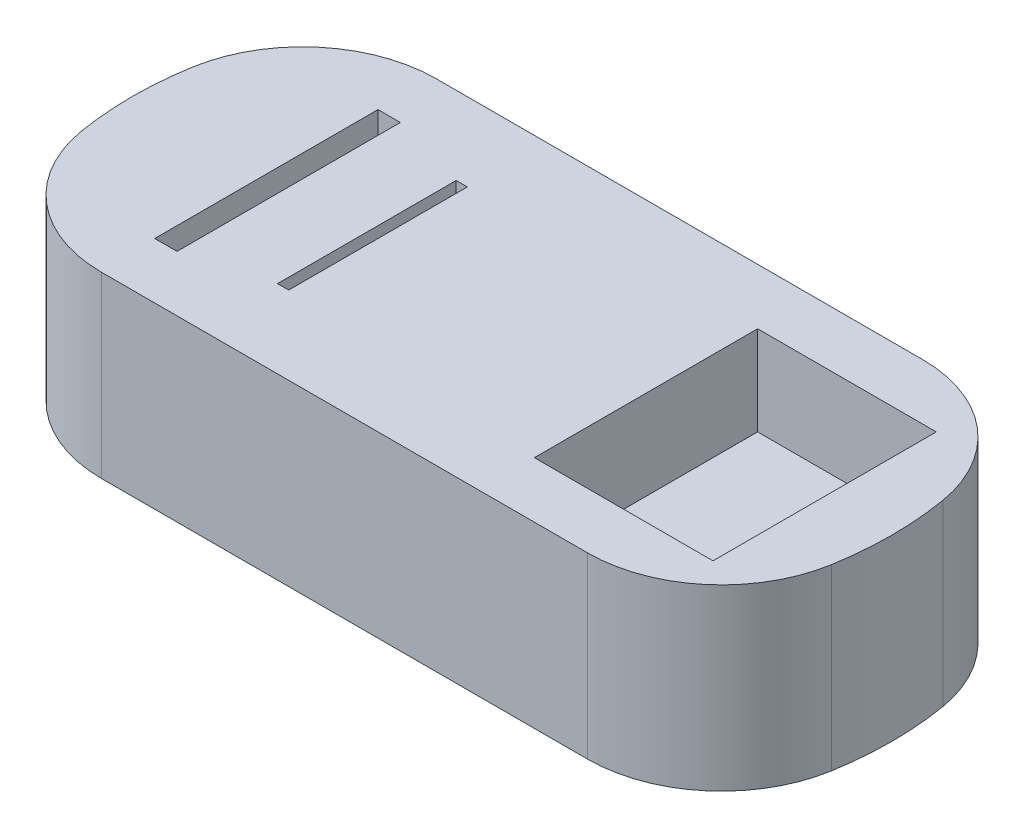
ISO-10303-21;
HEADER;
FILE_DESCRIPTION(('STEP AP214'),'2;1');
FILE_NAME('part.step','',(''),(''),'','','');
FILE_SCHEMA(('AUTOMOTIVE_DESIGN { 1 0 10303 214 1 1 1 1 }'));
ENDSEC;
DATA;
#1=APPLICATION_CONTEXT('core data for automotive mechanical design processes');
#2=APPLICATION_PROTOCOL_DEFINITION('international standard','automotive_design',2000,#1);
#3=PRODUCT_CONTEXT('',#1,'mechanical');
#4=PRODUCT('Part','Part','',(#3));
#5=PRODUCT_RELATED_PRODUCT_CATEGORY('part','',(#4));
#6=PRODUCT_DEFINITION_FORMATION('','',#4);
#7=PRODUCT_DEFINITION_CONTEXT('part definition',#1,'design');
#8=PRODUCT_DEFINITION('design','',#6,#7);
#9=PRODUCT_DEFINITION_SHAPE('','',#8);
#10=(LENGTH_UNIT() NAMED_UNIT(*) SI_UNIT(.MILLI.,.METRE.));
#11=(NAMED_UNIT(*) PLANE_ANGLE_UNIT() SI_UNIT($,.RADIAN.));
#12=(NAMED_UNIT(*) SI_UNIT($,.STERADIAN.) SOLID_ANGLE_UNIT());
#13=UNCERTAINTY_MEASURE_WITH_UNIT(LENGTH_MEASURE(1.E-05),#10,'distance_accuracy_value','');
#14=(GEOMETRIC_REPRESENTATION_CONTEXT(3) GLOBAL_UNCERTAINTY_ASSIGNED_CONTEXT((#13)) GLOBAL_UNIT_ASSIGNED_CONTEXT((#10,
#11,#12)) REPRESENTATION_CONTEXT('',''));
#15=CARTESIAN_POINT('',(0.,0.,0.));
#16=DIRECTION('',(0.,0.,1.));
#17=DIRECTION('',(1.,0.,0.));
#18=AXIS2_PLACEMENT_3D('',#15,#16,#17);
#19=CARTESIAN_POINT('',(20.0961894323342,80.,0.));
#20=DIRECTION('',(0.,-1.,0.));
#21=DIRECTION('',(0.,0.,-1.));
#22=AXIS2_PLACEMENT_3D('',#19,#20,#21);
#23=CYLINDRICAL_SURFACE('',#22,150.);
#24=CARTESIAN_POINT('',(20.0961894323342,0.,0.));
#25=DIRECTION('',(0.,1.,0.));
#26=DIRECTION('',(0.,0.,-1.));
#27=AXIS2_PLACEMENT_3D('',#24,#25,#26);
#28=CIRCLE('',#27,150.);
#29=CARTESIAN_POINT('',(167.998184009825,0.,25.));
#30=VERTEX_POINT('',#29);
#31=CARTESIAN_POINT('',(167.998184009825,0.,-25.));
#32=VERTEX_POINT('',#31);
#33=EDGE_CURVE('E266',#30,#32,#28,.T.);
#34=ORIENTED_EDGE('',*,*,#33,.T.);
#35=DIRECTION('',(0.,-1.,0.));
#36=VECTOR('',#35,1.);
#37=CARTESIAN_POINT('',(167.998184009825,80.,-25.));
#38=LINE('',#37,#36);
#39=CARTESIAN_POINT('',(167.998184009825,80.,-25.));
#40=VERTEX_POINT('',#39);
#41=EDGE_CURVE('E325',#32,#40,#38,.F.);
#42=ORIENTED_EDGE('',*,*,#41,.T.);
#43=CARTESIAN_POINT('',(20.0961894323342,80.,0.));
#44=DIRECTION('',(0.,1.,0.));
#45=DIRECTION('',(0.,0.,-1.));
#46=AXIS2_PLACEMENT_3D('',#43,#44,#45);
#47=CIRCLE('',#46,150.);
#48=CARTESIAN_POINT('',(167.998184009825,80.,25.));
#49=VERTEX_POINT('',#48);
#50=EDGE_CURVE('E273',#49,#40,#47,.T.);
#51=ORIENTED_EDGE('',*,*,#50,.F.);
#52=DIRECTION('',(0.,-1.,0.));
#53=VECTOR('',#52,1.);
#54=CARTESIAN_POINT('',(167.998184009825,80.,25.));
#55=LINE('',#54,#53);
#56=EDGE_CURVE('E322',#49,#30,#55,.T.);
#57=ORIENTED_EDGE('',*,*,#56,.T.);
#58=EDGE_LOOP('',(#34,#42,#51,#57));
#59=FACE_BOUND('',#58,.T.);
#60=ADVANCED_FACE('F38',(#59),#23,.T.);
#61=CARTESIAN_POINT('',(-150.,80.,-75.));
#62=DIRECTION('',(0.,0.,1.));
#63=DIRECTION('',(1.,0.,0.));
#64=AXIS2_PLACEMENT_3D('',#61,#62,#63);
#65=PLANE('',#64);
#66=DIRECTION('',(-1.,0.,0.));
#67=VECTOR('',#66,1.);
#68=CARTESIAN_POINT('',(-150.,0.,-75.));
#69=LINE('',#68,#67);
#70=CARTESIAN_POINT('',(108.837386178828,0.,-75.));
#71=VERTEX_POINT('',#70);
#72=CARTESIAN_POINT('',(-108.837386178828,0.,-75.));
#73=VERTEX_POINT('',#72);
#74=EDGE_CURVE('E289',#71,#73,#69,.T.);
#75=ORIENTED_EDGE('',*,*,#74,.T.);
#76=DIRECTION('',(0.,-1.,0.));
#77=VECTOR('',#76,1.);
#78=CARTESIAN_POINT('',(-108.837386178828,80.,-75.));
#79=LINE('',#78,#77);
#80=CARTESIAN_POINT('',(-108.837386178828,80.,-75.));
#81=VERTEX_POINT('',#80);
#82=EDGE_CURVE('E312',#73,#81,#79,.F.);
#83=ORIENTED_EDGE('',*,*,#82,.T.);
#84=DIRECTION('',(-1.,0.,0.));
#85=VECTOR('',#84,1.);
#86=CARTESIAN_POINT('',(-150.,80.,-75.));
#87=LINE('',#86,#85);
#88=CARTESIAN_POINT('',(108.837386178828,80.,-75.));
#89=VERTEX_POINT('',#88);
#90=EDGE_CURVE('E276',#89,#81,#87,.T.);
#91=ORIENTED_EDGE('',*,*,#90,.F.);
#92=DIRECTION('',(0.,-1.,0.));
#93=VECTOR('',#92,1.);
#94=CARTESIAN_POINT('',(108.837386178828,80.,-75.));
#95=LINE('',#94,#93);
#96=EDGE_CURVE('E309',#89,#71,#95,.T.);
#97=ORIENTED_EDGE('',*,*,#96,.T.);
#98=EDGE_LOOP('',(#75,#83,#91,#97));
#99=FACE_BOUND('',#98,.T.);
#100=ADVANCED_FACE('F355',(#99),#65,.F.);
#101=CARTESIAN_POINT('',(-20.0961894323342,80.,0.));
#102=DIRECTION('',(0.,-1.,0.));
#103=DIRECTION('',(0.,0.,-1.));
#104=AXIS2_PLACEMENT_3D('',#101,#102,#103);
#105=CYLINDRICAL_SURFACE('',#104,150.);
#106=CARTESIAN_POINT('',(-20.0961894323342,80.,0.));
#107=DIRECTION('',(0.,1.,0.));
#108=DIRECTION('',(0.,0.,1.));
#109=AXIS2_PLACEMENT_3D('',#106,#107,#108);
#110=CIRCLE('',#109,150.);
#111=CARTESIAN_POINT('',(-167.998184009825,80.,-25.));
#112=VERTEX_POINT('',#111);
#113=CARTESIAN_POINT('',(-167.998184009825,80.,25.));
#114=VERTEX_POINT('',#113);
#115=EDGE_CURVE('E280',#112,#114,#110,.T.);
#116=ORIENTED_EDGE('',*,*,#115,.F.);
#117=DIRECTION('',(0.,-1.,0.));
#118=VECTOR('',#117,1.);
#119=CARTESIAN_POINT('',(-167.998184009825,80.,-25.));
#120=LINE('',#119,#118);
#121=CARTESIAN_POINT('',(-167.998184009825,0.,-25.));
#122=VERTEX_POINT('',#121);
#123=EDGE_CURVE('E298',#112,#122,#120,.T.);
#124=ORIENTED_EDGE('',*,*,#123,.T.);
#125=CARTESIAN_POINT('',(-20.0961894323342,0.,0.));
#126=DIRECTION('',(0.,1.,0.));
#127=DIRECTION('',(0.,0.,1.));
#128=AXIS2_PLACEMENT_3D('',#125,#126,#127);
#129=CIRCLE('',#128,150.);
#130=CARTESIAN_POINT('',(-167.998184009825,0.,25.));
#131=VERTEX_POINT('',#130);
#132=EDGE_CURVE('E292',#122,#131,#129,.T.);
#133=ORIENTED_EDGE('',*,*,#132,.T.);
#134=DIRECTION('',(0.,-1.,0.));
#135=VECTOR('',#134,1.);
#136=CARTESIAN_POINT('',(-167.998184009825,80.,25.));
#137=LINE('',#136,#135);
#138=EDGE_CURVE('E286',#131,#114,#137,.F.);
#139=ORIENTED_EDGE('',*,*,#138,.T.);
#140=EDGE_LOOP('',(#116,#124,#133,#139));
#141=FACE_BOUND('',#140,.T.);
#142=ADVANCED_FACE('F363',(#141),#105,.T.);
#143=CARTESIAN_POINT('',(-150.,80.,75.));
#144=DIRECTION('',(0.,0.,-1.));
#145=DIRECTION('',(-1.,0.,0.));
#146=AXIS2_PLACEMENT_3D('',#143,#144,#145);
#147=PLANE('',#146);
#148=DIRECTION('',(1.,0.,0.));
#149=VECTOR('',#148,1.);
#150=CARTESIAN_POINT('',(-150.,0.,75.));
#151=LINE('',#150,#149);
#152=CARTESIAN_POINT('',(-108.837386178828,0.,75.));
#153=VERTEX_POINT('',#152);
#154=CARTESIAN_POINT('',(108.837386178828,0.,75.));
#155=VERTEX_POINT('',#154);
#156=EDGE_CURVE('E277',#153,#155,#151,.T.);
#157=ORIENTED_EDGE('',*,*,#156,.T.);
#158=DIRECTION('',(0.,-1.,0.));
#159=VECTOR('',#158,1.);
#160=CARTESIAN_POINT('',(108.837386178828,80.,75.));
#161=LINE('',#160,#159);
#162=CARTESIAN_POINT('',(108.837386178828,80.,75.));
#163=VERTEX_POINT('',#162);
#164=EDGE_CURVE('E11',#155,#163,#161,.F.);
#165=ORIENTED_EDGE('',*,*,#164,.T.);
#166=DIRECTION('',(1.,0.,0.));
#167=VECTOR('',#166,1.);
#168=CARTESIAN_POINT('',(-150.,80.,75.));
#169=LINE('',#168,#167);
#170=CARTESIAN_POINT('',(-108.837386178828,80.,75.));
#171=VERTEX_POINT('',#170);
#172=EDGE_CURVE('E283',#171,#163,#169,.T.);
#173=ORIENTED_EDGE('',*,*,#172,.F.);
#174=DIRECTION('',(0.,-1.,0.));
#175=VECTOR('',#174,1.);
#176=CARTESIAN_POINT('',(-108.837386178828,80.,75.));
#177=LINE('',#176,#175);
#178=EDGE_CURVE('E46',#171,#153,#177,.T.);
#179=ORIENTED_EDGE('',*,*,#178,.T.);
#180=EDGE_LOOP('',(#157,#165,#173,#179));
#181=FACE_BOUND('',#180,.T.);
#182=ADVANCED_FACE('F331',(#181),#147,.F.);
#183=CARTESIAN_POINT('',(20.0961894323342,80.,0.));
#184=DIRECTION('',(0.,-1.,0.));
#185=DIRECTION('',(0.,0.,-1.));
#186=AXIS2_PLACEMENT_3D('',#183,#184,#185);
#187=PLANE('',#186);
#188=DIRECTION('',(0.,0.,1.));
#189=VECTOR('',#188,1.);
#190=CARTESIAN_POINT('',(140.,80.,-50.));
#191=LINE('',#190,#189);
#192=CARTESIAN_POINT('',(140.,80.,-50.));
#193=VERTEX_POINT('',#192);
#194=CARTESIAN_POINT('',(140.,80.,50.));
#195=VERTEX_POINT('',#194);
#196=EDGE_CURVE('E203',#193,#195,#191,.T.);
#197=ORIENTED_EDGE('',*,*,#196,.T.);
#198=DIRECTION('',(1.,0.,0.));
#199=VECTOR('',#198,1.);
#200=CARTESIAN_POINT('',(60.,80.,50.));
#201=LINE('',#200,#199);
#202=CARTESIAN_POINT('',(60.,80.,50.));
#203=VERTEX_POINT('',#202);
#204=EDGE_CURVE('E53',#203,#195,#201,.T.);
#205=ORIENTED_EDGE('',*,*,#204,.F.);
#206=DIRECTION('',(0.,0.,1.));
#207=VECTOR('',#206,1.);
#208=CARTESIAN_POINT('',(60.,80.,-50.));
#209=LINE('',#208,#207);
#210=CARTESIAN_POINT('',(60.,80.,-50.));
#211=VERTEX_POINT('',#210);
#212=EDGE_CURVE('E194',#211,#203,#209,.T.);
#213=ORIENTED_EDGE('',*,*,#212,.F.);
#214=DIRECTION('',(1.,0.,0.));
#215=VECTOR('',#214,1.);
#216=CARTESIAN_POINT('',(60.,80.,-50.));
#217=LINE('',#216,#215);
#218=EDGE_CURVE('E197',#211,#193,#217,.T.);
#219=ORIENTED_EDGE('',*,*,#218,.T.);
#220=EDGE_LOOP('',(#197,#205,#213,#219));
#221=FACE_BOUND('',#220,.T.);
#222=DIRECTION('',(1.,0.,0.));
#223=VECTOR('',#222,1.);
#224=CARTESIAN_POINT('',(-65.,80.,40.));
#225=LINE('',#224,#223);
#226=CARTESIAN_POINT('',(-65.,80.,40.));
#227=VERTEX_POINT('',#226);
#228=CARTESIAN_POINT('',(-60.,80.,40.));
#229=VERTEX_POINT('',#228);
#230=EDGE_CURVE('E227',#227,#229,#225,.T.);
#231=ORIENTED_EDGE('',*,*,#230,.F.);
#232=DIRECTION('',(0.,0.,1.));
#233=VECTOR('',#232,1.);
#234=CARTESIAN_POINT('',(-65.0000000000001,80.,-40.));
#235=LINE('',#234,#233);
#236=CARTESIAN_POINT('',(-65.0000000000001,80.,-40.));
#237=VERTEX_POINT('',#236);
#238=EDGE_CURVE('E61',#237,#227,#235,.T.);
#239=ORIENTED_EDGE('',*,*,#238,.F.);
#240=DIRECTION('',(-1.,0.,0.));
#241=VECTOR('',#240,1.);
#242=CARTESIAN_POINT('',(-65.0000000000001,80.,-40.));
#243=LINE('',#242,#241);
#244=CARTESIAN_POINT('',(-60.,80.,-40.));
#245=VERTEX_POINT('',#244);
#246=EDGE_CURVE('E216',#245,#237,#243,.T.);
#247=ORIENTED_EDGE('',*,*,#246,.F.);
#248=DIRECTION('',(0.,0.,-1.));
#249=VECTOR('',#248,1.);
#250=CARTESIAN_POINT('',(-60.,80.,-40.));
#251=LINE('',#250,#249);
#252=EDGE_CURVE('E230',#229,#245,#251,.T.);
#253=ORIENTED_EDGE('',*,*,#252,.F.);
#254=EDGE_LOOP('',(#231,#239,#247,#253));
#255=FACE_BOUND('',#254,.T.);
#256=DIRECTION('',(0.,0.,1.));
#257=VECTOR('',#256,1.);
#258=CARTESIAN_POINT('',(-100.,80.,-50.));
#259=LINE('',#258,#257);
#260=CARTESIAN_POINT('',(-100.,80.,-50.));
#261=VERTEX_POINT('',#260);
#262=CARTESIAN_POINT('',(-100.,80.,50.));
#263=VERTEX_POINT('',#262);
#264=EDGE_CURVE('E256',#261,#263,#259,.T.);
#265=ORIENTED_EDGE('',*,*,#264,.T.);
#266=DIRECTION('',(1.,0.,0.));
#267=VECTOR('',#266,1.);
#268=CARTESIAN_POINT('',(-110.,80.,50.));
#269=LINE('',#268,#267);
#270=CARTESIAN_POINT('',(-110.,80.,50.));
#271=VERTEX_POINT('',#270);
#272=EDGE_CURVE('E237',#271,#263,#269,.T.);
#273=ORIENTED_EDGE('',*,*,#272,.F.);
#274=DIRECTION('',(0.,0.,1.));
#275=VECTOR('',#274,1.);
#276=CARTESIAN_POINT('',(-110.,80.,-50.));
#277=LINE('',#276,#275);
#278=CARTESIAN_POINT('',(-110.,80.,-50.));
#279=VERTEX_POINT('',#278);
#280=EDGE_CURVE('E247',#279,#271,#277,.T.);
#281=ORIENTED_EDGE('',*,*,#280,.F.);
#282=DIRECTION('',(1.,0.,0.));
#283=VECTOR('',#282,1.);
#284=CARTESIAN_POINT('',(-110.,80.,-50.));
#285=LINE('',#284,#283);
#286=EDGE_CURVE('E259',#279,#261,#285,.T.);
#287=ORIENTED_EDGE('',*,*,#286,.T.);
#288=EDGE_LOOP('',(#265,#273,#281,#287));
#289=FACE_BOUND('',#288,.T.);
#290=ORIENTED_EDGE('',*,*,#90,.T.);
#291=CARTESIAN_POINT('',(-108.837386178828,80.,-15.));
#292=DIRECTION('',(0.,-1.,0.));
#293=DIRECTION('',(0.,0.,-1.));
#294=AXIS2_PLACEMENT_3D('',#291,#292,#293);
#295=CIRCLE('',#294,60.);
#296=EDGE_CURVE('E320',#81,#112,#295,.F.);
#297=ORIENTED_EDGE('',*,*,#296,.T.);
#298=ORIENTED_EDGE('',*,*,#115,.T.);
#299=CARTESIAN_POINT('',(-108.837386178828,80.,15.));
#300=DIRECTION('',(0.,-1.,0.));
#301=DIRECTION('',(0.,0.,-1.));
#302=AXIS2_PLACEMENT_3D('',#299,#300,#301);
#303=CIRCLE('',#302,60.);
#304=EDGE_CURVE('E314',#114,#171,#303,.F.);
#305=ORIENTED_EDGE('',*,*,#304,.T.);
#306=ORIENTED_EDGE('',*,*,#172,.T.);
#307=CARTESIAN_POINT('',(108.837386178828,80.,15.));
#308=DIRECTION('',(0.,-1.,0.));
#309=DIRECTION('',(0.,0.,-1.));
#310=AXIS2_PLACEMENT_3D('',#307,#308,#309);
#311=CIRCLE('',#310,60.);
#312=EDGE_CURVE('E316',#163,#49,#311,.F.);
#313=ORIENTED_EDGE('',*,*,#312,.T.);
#314=ORIENTED_EDGE('',*,*,#50,.T.);
#315=CARTESIAN_POINT('',(108.837386178828,80.,-15.));
#316=DIRECTION('',(0.,-1.,0.));
#317=DIRECTION('',(0.,0.,-1.));
#318=AXIS2_PLACEMENT_3D('',#315,#316,#317);
#319=CIRCLE('',#318,60.);
#320=EDGE_CURVE('E318',#40,#89,#319,.F.);
#321=ORIENTED_EDGE('',*,*,#320,.T.);
#322=EDGE_LOOP('',(#290,#297,#298,#305,#306,#313,#314,#321));
#323=FACE_BOUND('',#322,.T.);
#324=ADVANCED_FACE('F348',(#221,#255,#289,#323),#187,.F.);
#325=CARTESIAN_POINT('',(20.0961894323342,0.,0.));
#326=DIRECTION('',(0.,-1.,0.));
#327=DIRECTION('',(0.,0.,-1.));
#328=AXIS2_PLACEMENT_3D('',#325,#326,#327);
#329=PLANE('',#328);
#330=ORIENTED_EDGE('',*,*,#132,.F.);
#331=CARTESIAN_POINT('',(-108.837386178828,0.,-15.));
#332=DIRECTION('',(0.,-1.,0.));
#333=DIRECTION('',(0.,0.,-1.));
#334=AXIS2_PLACEMENT_3D('',#331,#332,#333);
#335=CIRCLE('',#334,60.);
#336=EDGE_CURVE('E307',#122,#73,#335,.T.);
#337=ORIENTED_EDGE('',*,*,#336,.T.);
#338=ORIENTED_EDGE('',*,*,#74,.F.);
#339=CARTESIAN_POINT('',(108.837386178828,0.,-15.));
#340=DIRECTION('',(0.,-1.,0.));
#341=DIRECTION('',(0.,0.,-1.));
#342=AXIS2_PLACEMENT_3D('',#339,#340,#341);
#343=CIRCLE('',#342,60.);
#344=EDGE_CURVE('E305',#71,#32,#343,.T.);
#345=ORIENTED_EDGE('',*,*,#344,.T.);
#346=ORIENTED_EDGE('',*,*,#33,.F.);
#347=CARTESIAN_POINT('',(108.837386178828,0.,15.));
#348=DIRECTION('',(0.,-1.,0.));
#349=DIRECTION('',(0.,0.,-1.));
#350=AXIS2_PLACEMENT_3D('',#347,#348,#349);
#351=CIRCLE('',#350,60.);
#352=EDGE_CURVE('E303',#30,#155,#351,.T.);
#353=ORIENTED_EDGE('',*,*,#352,.T.);
#354=ORIENTED_EDGE('',*,*,#156,.F.);
#355=CARTESIAN_POINT('',(-108.837386178828,0.,15.));
#356=DIRECTION('',(0.,-1.,0.));
#357=DIRECTION('',(0.,0.,-1.));
#358=AXIS2_PLACEMENT_3D('',#355,#356,#357);
#359=CIRCLE('',#358,60.);
#360=EDGE_CURVE('E301',#153,#131,#359,.T.);
#361=ORIENTED_EDGE('',*,*,#360,.T.);
#362=EDGE_LOOP('',(#330,#337,#338,#345,#346,#353,#354,#361));
#363=FACE_BOUND('',#362,.T.);
#364=ADVANCED_FACE('F337',(#363),#329,.T.);
#365=CARTESIAN_POINT('',(-108.837386178828,80.,-15.));
#366=DIRECTION('',(0.,-1.,0.));
#367=DIRECTION('',(0.,0.,-1.));
#368=AXIS2_PLACEMENT_3D('',#365,#366,#367);
#369=CYLINDRICAL_SURFACE('',#368,60.);
#370=ORIENTED_EDGE('',*,*,#296,.F.);
#371=ORIENTED_EDGE('',*,*,#82,.F.);
#372=ORIENTED_EDGE('',*,*,#336,.F.);
#373=ORIENTED_EDGE('',*,*,#123,.F.);
#374=EDGE_LOOP('',(#370,#371,#372,#373));
#375=FACE_BOUND('',#374,.T.);
#376=ADVANCED_FACE('F360',(#375),#369,.T.);
#377=CARTESIAN_POINT('',(108.837386178828,80.,-15.));
#378=DIRECTION('',(0.,-1.,0.));
#379=DIRECTION('',(0.,0.,-1.));
#380=AXIS2_PLACEMENT_3D('',#377,#378,#379);
#381=CYLINDRICAL_SURFACE('',#380,60.);
#382=ORIENTED_EDGE('',*,*,#320,.F.);
#383=ORIENTED_EDGE('',*,*,#41,.F.);
#384=ORIENTED_EDGE('',*,*,#344,.F.);
#385=ORIENTED_EDGE('',*,*,#96,.F.);
#386=EDGE_LOOP('',(#382,#383,#384,#385));
#387=FACE_BOUND('',#386,.T.);
#388=ADVANCED_FACE('F352',(#387),#381,.T.);
#389=CARTESIAN_POINT('',(108.837386178828,80.,15.));
#390=DIRECTION('',(0.,-1.,0.));
#391=DIRECTION('',(0.,0.,-1.));
#392=AXIS2_PLACEMENT_3D('',#389,#390,#391);
#393=CYLINDRICAL_SURFACE('',#392,60.);
#394=ORIENTED_EDGE('',*,*,#312,.F.);
#395=ORIENTED_EDGE('',*,*,#164,.F.);
#396=ORIENTED_EDGE('',*,*,#352,.F.);
#397=ORIENTED_EDGE('',*,*,#56,.F.);
#398=EDGE_LOOP('',(#394,#395,#396,#397));
#399=FACE_BOUND('',#398,.T.);
#400=ADVANCED_FACE('F342',(#399),#393,.T.);
#401=CARTESIAN_POINT('',(-108.837386178828,80.,15.));
#402=DIRECTION('',(0.,-1.,0.));
#403=DIRECTION('',(0.,0.,-1.));
#404=AXIS2_PLACEMENT_3D('',#401,#402,#403);
#405=CYLINDRICAL_SURFACE('',#404,60.);
#406=ORIENTED_EDGE('',*,*,#304,.F.);
#407=ORIENTED_EDGE('',*,*,#138,.F.);
#408=ORIENTED_EDGE('',*,*,#360,.F.);
#409=ORIENTED_EDGE('',*,*,#178,.F.);
#410=EDGE_LOOP('',(#406,#407,#408,#409));
#411=FACE_BOUND('',#410,.T.);
#412=ADVANCED_FACE('F40',(#411),#405,.T.);
#413=CARTESIAN_POINT('',(-110.,60.,50.));
#414=DIRECTION('',(0.,0.,1.));
#415=DIRECTION('',(1.,0.,0.));
#416=AXIS2_PLACEMENT_3D('',#413,#414,#415);
#417=PLANE('',#416);
#418=ORIENTED_EDGE('',*,*,#272,.T.);
#419=DIRECTION('',(0.,1.,0.));
#420=VECTOR('',#419,1.);
#421=CARTESIAN_POINT('',(-100.,60.,50.));
#422=LINE('',#421,#420);
#423=CARTESIAN_POINT('',(-100.,60.,50.));
#424=VERTEX_POINT('',#423);
#425=EDGE_CURVE('E254',#424,#263,#422,.T.);
#426=ORIENTED_EDGE('',*,*,#425,.F.);
#427=DIRECTION('',(1.,0.,0.));
#428=VECTOR('',#427,1.);
#429=CARTESIAN_POINT('',(-110.,60.,50.));
#430=LINE('',#429,#428);
#431=CARTESIAN_POINT('',(-110.,60.,50.));
#432=VERTEX_POINT('',#431);
#433=EDGE_CURVE('E243',#432,#424,#430,.T.);
#434=ORIENTED_EDGE('',*,*,#433,.F.);
#435=DIRECTION('',(0.,1.,0.));
#436=VECTOR('',#435,1.);
#437=CARTESIAN_POINT('',(-110.,60.,50.));
#438=LINE('',#437,#436);
#439=EDGE_CURVE('E264',#432,#271,#438,.T.);
#440=ORIENTED_EDGE('',*,*,#439,.T.);
#441=EDGE_LOOP('',(#418,#426,#434,#440));
#442=FACE_BOUND('',#441,.T.);
#443=ADVANCED_FACE('F366',(#442),#417,.F.);
#444=CARTESIAN_POINT('',(-110.,60.,-50.));
#445=DIRECTION('',(-1.,0.,0.));
#446=DIRECTION('',(0.,0.,1.));
#447=AXIS2_PLACEMENT_3D('',#444,#445,#446);
#448=PLANE('',#447);
#449=ORIENTED_EDGE('',*,*,#280,.T.);
#450=ORIENTED_EDGE('',*,*,#439,.F.);
#451=DIRECTION('',(0.,0.,1.));
#452=VECTOR('',#451,1.);
#453=CARTESIAN_POINT('',(-110.,60.,-50.));
#454=LINE('',#453,#452);
#455=CARTESIAN_POINT('',(-110.,60.,-50.));
#456=VERTEX_POINT('',#455);
#457=EDGE_CURVE('E251',#456,#432,#454,.T.);
#458=ORIENTED_EDGE('',*,*,#457,.F.);
#459=DIRECTION('',(0.,1.,0.));
#460=VECTOR('',#459,1.);
#461=CARTESIAN_POINT('',(-110.,60.,-50.));
#462=LINE('',#461,#460);
#463=EDGE_CURVE('E267',#456,#279,#462,.T.);
#464=ORIENTED_EDGE('',*,*,#463,.T.);
#465=EDGE_LOOP('',(#449,#450,#458,#464));
#466=FACE_BOUND('',#465,.T.);
#467=ADVANCED_FACE('F371',(#466),#448,.F.);
#468=CARTESIAN_POINT('',(-110.,60.,-50.));
#469=DIRECTION('',(0.,0.,1.));
#470=DIRECTION('',(1.,0.,0.));
#471=AXIS2_PLACEMENT_3D('',#468,#469,#470);
#472=PLANE('',#471);
#473=ORIENTED_EDGE('',*,*,#286,.F.);
#474=ORIENTED_EDGE('',*,*,#463,.F.);
#475=DIRECTION('',(1.,0.,0.));
#476=VECTOR('',#475,1.);
#477=CARTESIAN_POINT('',(-110.,60.,-50.));
#478=LINE('',#477,#476);
#479=CARTESIAN_POINT('',(-100.,60.,-50.));
#480=VERTEX_POINT('',#479);
#481=EDGE_CURVE('E249',#456,#480,#478,.T.);
#482=ORIENTED_EDGE('',*,*,#481,.T.);
#483=DIRECTION('',(0.,1.,0.));
#484=VECTOR('',#483,1.);
#485=CARTESIAN_POINT('',(-100.,60.,-50.));
#486=LINE('',#485,#484);
#487=EDGE_CURVE('E269',#480,#261,#486,.T.);
#488=ORIENTED_EDGE('',*,*,#487,.T.);
#489=EDGE_LOOP('',(#473,#474,#482,#488));
#490=FACE_BOUND('',#489,.T.);
#491=ADVANCED_FACE('F415',(#490),#472,.T.);
#492=CARTESIAN_POINT('',(-100.,60.,-50.));
#493=DIRECTION('',(-1.,0.,0.));
#494=DIRECTION('',(0.,0.,1.));
#495=AXIS2_PLACEMENT_3D('',#492,#493,#494);
#496=PLANE('',#495);
#497=ORIENTED_EDGE('',*,*,#264,.F.);
#498=ORIENTED_EDGE('',*,*,#487,.F.);
#499=DIRECTION('',(0.,0.,1.));
#500=VECTOR('',#499,1.);
#501=CARTESIAN_POINT('',(-100.,60.,-50.));
#502=LINE('',#501,#500);
#503=EDGE_CURVE('E246',#480,#424,#502,.T.);
#504=ORIENTED_EDGE('',*,*,#503,.T.);
#505=ORIENTED_EDGE('',*,*,#425,.T.);
#506=EDGE_LOOP('',(#497,#498,#504,#505));
#507=FACE_BOUND('',#506,.T.);
#508=ADVANCED_FACE('F426',(#507),#496,.T.);
#509=CARTESIAN_POINT('',(0.,60.,0.));
#510=DIRECTION('',(0.,-1.,0.));
#511=DIRECTION('',(0.,0.,-1.));
#512=AXIS2_PLACEMENT_3D('',#509,#510,#511);
#513=PLANE('',#512);
#514=ORIENTED_EDGE('',*,*,#433,.T.);
#515=ORIENTED_EDGE('',*,*,#503,.F.);
#516=ORIENTED_EDGE('',*,*,#481,.F.);
#517=ORIENTED_EDGE('',*,*,#457,.T.);
#518=EDGE_LOOP('',(#514,#515,#516,#517));
#519=FACE_BOUND('',#518,.T.);
#520=ADVANCED_FACE('F437',(#519),#513,.F.);
#521=CARTESIAN_POINT('',(-65.0000000000001,40.,-40.));
#522=DIRECTION('',(-1.,0.,0.));
#523=DIRECTION('',(0.,0.,1.));
#524=AXIS2_PLACEMENT_3D('',#521,#522,#523);
#525=PLANE('',#524);
#526=ORIENTED_EDGE('',*,*,#238,.T.);
#527=DIRECTION('',(0.,1.,0.));
#528=VECTOR('',#527,1.);
#529=CARTESIAN_POINT('',(-65.,40.,40.));
#530=LINE('',#529,#528);
#531=CARTESIAN_POINT('',(-65.,40.,40.));
#532=VERTEX_POINT('',#531);
#533=EDGE_CURVE('E225',#532,#227,#530,.T.);
#534=ORIENTED_EDGE('',*,*,#533,.F.);
#535=DIRECTION('',(0.,0.,1.));
#536=VECTOR('',#535,1.);
#537=CARTESIAN_POINT('',(-65.0000000000001,40.,-40.));
#538=LINE('',#537,#536);
#539=CARTESIAN_POINT('',(-65.0000000000001,40.,-40.));
#540=VERTEX_POINT('',#539);
#541=EDGE_CURVE('E212',#540,#532,#538,.T.);
#542=ORIENTED_EDGE('',*,*,#541,.F.);
#543=DIRECTION('',(0.,1.,0.));
#544=VECTOR('',#543,1.);
#545=CARTESIAN_POINT('',(-65.0000000000001,40.,-40.));
#546=LINE('',#545,#544);
#547=EDGE_CURVE('E235',#540,#237,#546,.T.);
#548=ORIENTED_EDGE('',*,*,#547,.T.);
#549=EDGE_LOOP('',(#526,#534,#542,#548));
#550=FACE_BOUND('',#549,.T.);
#551=ADVANCED_FACE('F448',(#550),#525,.F.);
#552=CARTESIAN_POINT('',(-65.0000000000001,40.,-40.));
#553=DIRECTION('',(0.,0.,-1.));
#554=DIRECTION('',(-1.,0.,0.));
#555=AXIS2_PLACEMENT_3D('',#552,#553,#554);
#556=PLANE('',#555);
#557=ORIENTED_EDGE('',*,*,#246,.T.);
#558=ORIENTED_EDGE('',*,*,#547,.F.);
#559=DIRECTION('',(-1.,0.,0.));
#560=VECTOR('',#559,1.);
#561=CARTESIAN_POINT('',(-65.0000000000001,40.,-40.));
#562=LINE('',#561,#560);
#563=CARTESIAN_POINT('',(-60.,40.,-40.));
#564=VERTEX_POINT('',#563);
#565=EDGE_CURVE('E222',#564,#540,#562,.T.);
#566=ORIENTED_EDGE('',*,*,#565,.F.);
#567=DIRECTION('',(0.,1.,0.));
#568=VECTOR('',#567,1.);
#569=CARTESIAN_POINT('',(-60.,40.,-40.));
#570=LINE('',#569,#568);
#571=EDGE_CURVE('E238',#564,#245,#570,.T.);
#572=ORIENTED_EDGE('',*,*,#571,.T.);
#573=EDGE_LOOP('',(#557,#558,#566,#572));
#574=FACE_BOUND('',#573,.T.);
#575=ADVANCED_FACE('F459',(#574),#556,.F.);
#576=CARTESIAN_POINT('',(-60.,40.,-40.));
#577=DIRECTION('',(1.,0.,0.));
#578=DIRECTION('',(0.,0.,-1.));
#579=AXIS2_PLACEMENT_3D('',#576,#577,#578);
#580=PLANE('',#579);
#581=ORIENTED_EDGE('',*,*,#252,.T.);
#582=ORIENTED_EDGE('',*,*,#571,.F.);
#583=DIRECTION('',(0.,0.,-1.));
#584=VECTOR('',#583,1.);
#585=CARTESIAN_POINT('',(-60.,40.,-40.));
#586=LINE('',#585,#584);
#587=CARTESIAN_POINT('',(-60.,40.,40.));
#588=VERTEX_POINT('',#587);
#589=EDGE_CURVE('E219',#588,#564,#586,.T.);
#590=ORIENTED_EDGE('',*,*,#589,.F.);
#591=DIRECTION('',(0.,1.,0.));
#592=VECTOR('',#591,1.);
#593=CARTESIAN_POINT('',(-60.,40.,40.));
#594=LINE('',#593,#592);
#595=EDGE_CURVE('E240',#588,#229,#594,.T.);
#596=ORIENTED_EDGE('',*,*,#595,.T.);
#597=EDGE_LOOP('',(#581,#582,#590,#596));
#598=FACE_BOUND('',#597,.T.);
#599=ADVANCED_FACE('F469',(#598),#580,.F.);
#600=CARTESIAN_POINT('',(-65.,40.,40.));
#601=DIRECTION('',(0.,0.,1.));
#602=DIRECTION('',(1.,0.,0.));
#603=AXIS2_PLACEMENT_3D('',#600,#601,#602);
#604=PLANE('',#603);
#605=ORIENTED_EDGE('',*,*,#230,.T.);
#606=ORIENTED_EDGE('',*,*,#595,.F.);
#607=DIRECTION('',(1.,0.,0.));
#608=VECTOR('',#607,1.);
#609=CARTESIAN_POINT('',(-65.,40.,40.));
#610=LINE('',#609,#608);
#611=EDGE_CURVE('E215',#532,#588,#610,.T.);
#612=ORIENTED_EDGE('',*,*,#611,.F.);
#613=ORIENTED_EDGE('',*,*,#533,.T.);
#614=EDGE_LOOP('',(#605,#606,#612,#613));
#615=FACE_BOUND('',#614,.T.);
#616=ADVANCED_FACE('F480',(#615),#604,.F.);
#617=CARTESIAN_POINT('',(0.,40.,0.));
#618=DIRECTION('',(0.,1.,0.));
#619=DIRECTION('',(0.,0.,1.));
#620=AXIS2_PLACEMENT_3D('',#617,#618,#619);
#621=PLANE('',#620);
#622=ORIENTED_EDGE('',*,*,#541,.T.);
#623=ORIENTED_EDGE('',*,*,#611,.T.);
#624=ORIENTED_EDGE('',*,*,#589,.T.);
#625=ORIENTED_EDGE('',*,*,#565,.T.);
#626=EDGE_LOOP('',(#622,#623,#624,#625));
#627=FACE_BOUND('',#626,.T.);
#628=ADVANCED_FACE('F491',(#627),#621,.T.);
#629=CARTESIAN_POINT('',(60.,40.,50.));
#630=DIRECTION('',(0.,0.,1.));
#631=DIRECTION('',(1.,0.,0.));
#632=AXIS2_PLACEMENT_3D('',#629,#630,#631);
#633=PLANE('',#632);
#634=ORIENTED_EDGE('',*,*,#204,.T.);
#635=DIRECTION('',(0.,1.,0.));
#636=VECTOR('',#635,1.);
#637=CARTESIAN_POINT('',(140.,40.,50.));
#638=LINE('',#637,#636);
#639=CARTESIAN_POINT('',(140.,40.,50.));
#640=VERTEX_POINT('',#639);
#641=EDGE_CURVE('E178',#640,#195,#638,.T.);
#642=ORIENTED_EDGE('',*,*,#641,.F.);
#643=DIRECTION('',(1.,0.,0.));
#644=VECTOR('',#643,1.);
#645=CARTESIAN_POINT('',(60.,40.,50.));
#646=LINE('',#645,#644);
#647=CARTESIAN_POINT('',(60.,40.,50.));
#648=VERTEX_POINT('',#647);
#649=EDGE_CURVE('E185',#648,#640,#646,.T.);
#650=ORIENTED_EDGE('',*,*,#649,.F.);
#651=DIRECTION('',(0.,1.,0.));
#652=VECTOR('',#651,1.);
#653=CARTESIAN_POINT('',(60.,40.,50.));
#654=LINE('',#653,#652);
#655=EDGE_CURVE('E207',#648,#203,#654,.T.);
#656=ORIENTED_EDGE('',*,*,#655,.T.);
#657=EDGE_LOOP('',(#634,#642,#650,#656));
#658=FACE_BOUND('',#657,.T.);
#659=ADVANCED_FACE('F188',(#658),#633,.F.);
#660=CARTESIAN_POINT('',(60.,40.,-50.));
#661=DIRECTION('',(-1.,0.,0.));
#662=DIRECTION('',(0.,0.,1.));
#663=AXIS2_PLACEMENT_3D('',#660,#661,#662);
#664=PLANE('',#663);
#665=ORIENTED_EDGE('',*,*,#212,.T.);
#666=ORIENTED_EDGE('',*,*,#655,.F.);
#667=DIRECTION('',(0.,0.,1.));
#668=VECTOR('',#667,1.);
#669=CARTESIAN_POINT('',(60.,40.,-50.));
#670=LINE('',#669,#668);
#671=CARTESIAN_POINT('',(60.,40.,-50.));
#672=VERTEX_POINT('',#671);
#673=EDGE_CURVE('E190',#672,#648,#670,.T.);
#674=ORIENTED_EDGE('',*,*,#673,.F.);
#675=DIRECTION('',(0.,1.,0.));
#676=VECTOR('',#675,1.);
#677=CARTESIAN_POINT('',(60.,40.,-50.));
#678=LINE('',#677,#676);
#679=EDGE_CURVE('E209',#672,#211,#678,.T.);
#680=ORIENTED_EDGE('',*,*,#679,.T.);
#681=EDGE_LOOP('',(#665,#666,#674,#680));
#682=FACE_BOUND('',#681,.T.);
#683=ADVANCED_FACE('F523',(#682),#664,.F.);
#684=CARTESIAN_POINT('',(60.,40.,-50.));
#685=DIRECTION('',(0.,0.,1.));
#686=DIRECTION('',(1.,0.,0.));
#687=AXIS2_PLACEMENT_3D('',#684,#685,#686);
#688=PLANE('',#687);
#689=ORIENTED_EDGE('',*,*,#218,.F.);
#690=ORIENTED_EDGE('',*,*,#679,.F.);
#691=DIRECTION('',(1.,0.,0.));
#692=VECTOR('',#691,1.);
#693=CARTESIAN_POINT('',(60.,40.,-50.));
#694=LINE('',#693,#692);
#695=CARTESIAN_POINT('',(140.,40.,-50.));
#696=VERTEX_POINT('',#695);
#697=EDGE_CURVE('E184',#672,#696,#694,.T.);
#698=ORIENTED_EDGE('',*,*,#697,.T.);
#699=DIRECTION('',(0.,1.,0.));
#700=VECTOR('',#699,1.);
#701=CARTESIAN_POINT('',(140.,40.,-50.));
#702=LINE('',#701,#700);
#703=EDGE_CURVE('E180',#696,#193,#702,.T.);
#704=ORIENTED_EDGE('',*,*,#703,.T.);
#705=EDGE_LOOP('',(#689,#690,#698,#704));
#706=FACE_BOUND('',#705,.T.);
#707=ADVANCED_FACE('F533',(#706),#688,.T.);
#708=CARTESIAN_POINT('',(140.,40.,-50.));
#709=DIRECTION('',(-1.,0.,0.));
#710=DIRECTION('',(0.,0.,1.));
#711=AXIS2_PLACEMENT_3D('',#708,#709,#710);
#712=PLANE('',#711);
#713=ORIENTED_EDGE('',*,*,#196,.F.);
#714=ORIENTED_EDGE('',*,*,#703,.F.);
#715=DIRECTION('',(0.,0.,1.));
#716=VECTOR('',#715,1.);
#717=CARTESIAN_POINT('',(140.,40.,-50.));
#718=LINE('',#717,#716);
#719=EDGE_CURVE('E175',#696,#640,#718,.T.);
#720=ORIENTED_EDGE('',*,*,#719,.T.);
#721=ORIENTED_EDGE('',*,*,#641,.T.);
#722=EDGE_LOOP('',(#713,#714,#720,#721));
#723=FACE_BOUND('',#722,.T.);
#724=ADVANCED_FACE('F177',(#723),#712,.T.);
#725=CARTESIAN_POINT('',(0.,40.,0.));
#726=DIRECTION('',(0.,-1.,0.));
#727=DIRECTION('',(0.,0.,-1.));
#728=AXIS2_PLACEMENT_3D('',#725,#726,#727);
#729=PLANE('',#728);
#730=ORIENTED_EDGE('',*,*,#649,.T.);
#731=ORIENTED_EDGE('',*,*,#719,.F.);
#732=ORIENTED_EDGE('',*,*,#697,.F.);
#733=ORIENTED_EDGE('',*,*,#673,.T.);
#734=EDGE_LOOP('',(#730,#731,#732,#733));
#735=FACE_BOUND('',#734,.T.);
#736=ADVANCED_FACE('F192',(#735),#729,.F.);
#737=CLOSED_SHELL('',(#60,#100,#142,#182,#324,#364,#376,#388,#400,#412,#443,#467,#491,#508,#520,
#551,#575,#599,#616,#628,#659,#683,#707,#724,#736));
#738=MANIFOLD_SOLID_BREP('B2',#737);
#739=ADVANCED_BREP_SHAPE_REPRESENTATION('',(#18,#738),#14);
#740=SHAPE_DEFINITION_REPRESENTATION(#9,#739);
ENDSEC;
END-ISO-10303-21;
